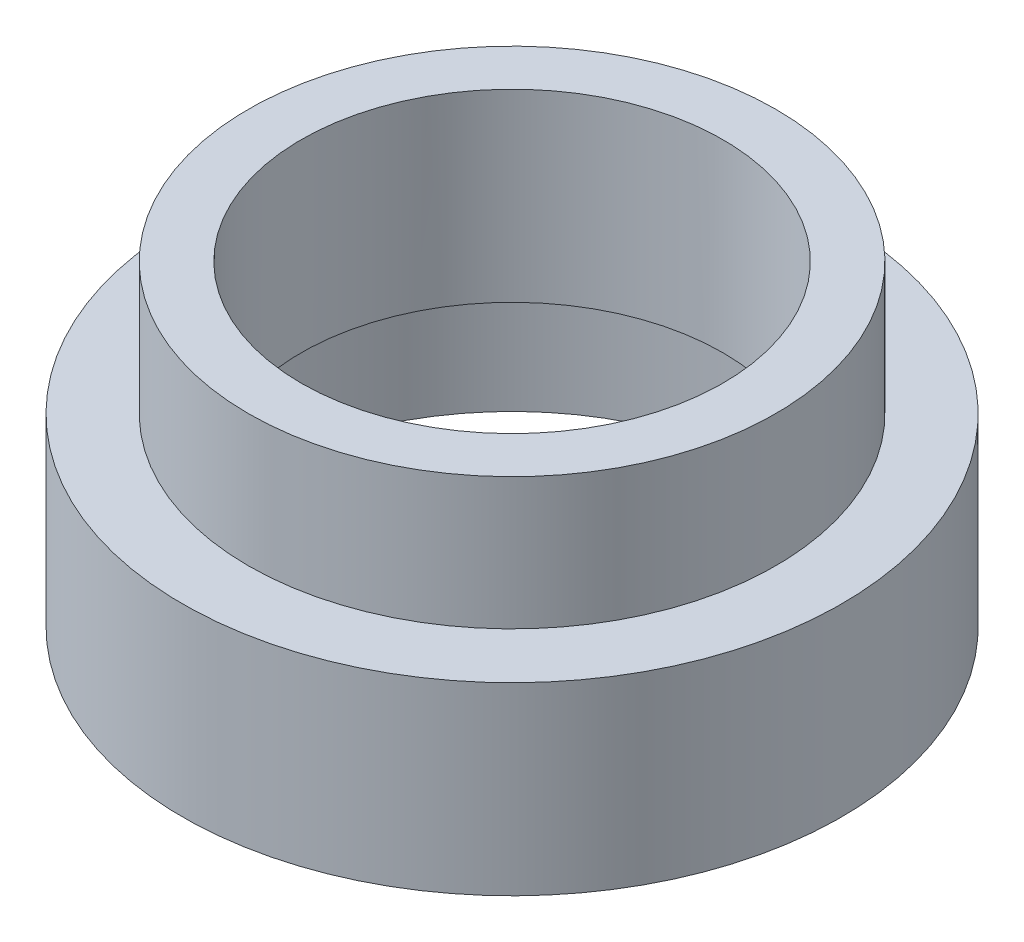
ISO-10303-21;
HEADER;
FILE_DESCRIPTION(('STEP AP214'),'2;1');
FILE_NAME('part.step','',(''),(''),'','','');
FILE_SCHEMA(('AUTOMOTIVE_DESIGN { 1 0 10303 214 1 1 1 1 }'));
ENDSEC;
DATA;
#1=APPLICATION_CONTEXT('core data for automotive mechanical design processes');
#2=APPLICATION_PROTOCOL_DEFINITION('international standard','automotive_design',2000,#1);
#3=PRODUCT_CONTEXT('',#1,'mechanical');
#4=PRODUCT('Part','Part','',(#3));
#5=PRODUCT_RELATED_PRODUCT_CATEGORY('part','',(#4));
#6=PRODUCT_DEFINITION_FORMATION('','',#4);
#7=PRODUCT_DEFINITION_CONTEXT('part definition',#1,'design');
#8=PRODUCT_DEFINITION('design','',#6,#7);
#9=PRODUCT_DEFINITION_SHAPE('','',#8);
#10=(LENGTH_UNIT() NAMED_UNIT(*) SI_UNIT(.MILLI.,.METRE.));
#11=(NAMED_UNIT(*) PLANE_ANGLE_UNIT() SI_UNIT($,.RADIAN.));
#12=(NAMED_UNIT(*) SI_UNIT($,.STERADIAN.) SOLID_ANGLE_UNIT());
#13=UNCERTAINTY_MEASURE_WITH_UNIT(LENGTH_MEASURE(1.E-05),#10,'distance_accuracy_value','');
#14=(GEOMETRIC_REPRESENTATION_CONTEXT(3) GLOBAL_UNCERTAINTY_ASSIGNED_CONTEXT((#13)) GLOBAL_UNIT_ASSIGNED_CONTEXT((#10,
#11,#12)) REPRESENTATION_CONTEXT('',''));
#15=CARTESIAN_POINT('',(0.,0.,0.));
#16=DIRECTION('',(0.,0.,1.));
#17=DIRECTION('',(1.,0.,0.));
#18=AXIS2_PLACEMENT_3D('',#15,#16,#17);
#19=CARTESIAN_POINT('',(0.,-5.,0.));
#20=DIRECTION('',(0.,1.,0.));
#21=DIRECTION('',(0.,0.,1.));
#22=AXIS2_PLACEMENT_3D('',#19,#20,#21);
#23=CYLINDRICAL_SURFACE('',#22,4.);
#24=CARTESIAN_POINT('',(0.,2.5,0.));
#25=DIRECTION('',(0.,1.,0.));
#26=DIRECTION('',(0.,0.,1.));
#27=AXIS2_PLACEMENT_3D('',#24,#25,#26);
#28=CIRCLE('',#27,4.);
#29=CARTESIAN_POINT('',(0.,2.5,4.));
#30=VERTEX_POINT('',#29);
#31=EDGE_CURVE('E49',#30,#30,#28,.T.);
#32=ORIENTED_EDGE('',*,*,#31,.T.);
#33=EDGE_LOOP('',(#32));
#34=FACE_BOUND('',#33,.T.);
#35=CARTESIAN_POINT('',(0.,-1.,0.));
#36=DIRECTION('',(0.,-1.,0.));
#37=DIRECTION('',(0.,0.,-1.));
#38=AXIS2_PLACEMENT_3D('',#35,#36,#37);
#39=CIRCLE('',#38,4.);
#40=CARTESIAN_POINT('',(0.,-1.,-4.));
#41=VERTEX_POINT('',#40);
#42=EDGE_CURVE('E35',#41,#41,#39,.F.);
#43=ORIENTED_EDGE('',*,*,#42,.F.);
#44=EDGE_LOOP('',(#43));
#45=FACE_BOUND('',#44,.T.);
#46=ADVANCED_FACE('F31',(#34,#45),#23,.F.);
#47=CARTESIAN_POINT('',(0.,2.5,0.));
#48=DIRECTION('',(0.,-1.,0.));
#49=DIRECTION('',(0.,0.,-1.));
#50=AXIS2_PLACEMENT_3D('',#47,#48,#49);
#51=CYLINDRICAL_SURFACE('',#50,5.);
#52=CARTESIAN_POINT('',(0.,2.5,0.));
#53=DIRECTION('',(0.,1.,0.));
#54=DIRECTION('',(0.,0.,1.));
#55=AXIS2_PLACEMENT_3D('',#52,#53,#54);
#56=CIRCLE('',#55,5.);
#57=CARTESIAN_POINT('',(0.,2.5,5.));
#58=VERTEX_POINT('',#57);
#59=EDGE_CURVE('E10',#58,#58,#56,.T.);
#60=ORIENTED_EDGE('',*,*,#59,.F.);
#61=EDGE_LOOP('',(#60));
#62=FACE_BOUND('',#61,.T.);
#63=CARTESIAN_POINT('',(0.,0.,0.));
#64=DIRECTION('',(0.,-1.,0.));
#65=DIRECTION('',(0.,0.,-1.));
#66=AXIS2_PLACEMENT_3D('',#63,#64,#65);
#67=CIRCLE('',#66,5.);
#68=CARTESIAN_POINT('',(0.,0.,-5.));
#69=VERTEX_POINT('',#68);
#70=EDGE_CURVE('E39',#69,#69,#67,.T.);
#71=ORIENTED_EDGE('',*,*,#70,.F.);
#72=EDGE_LOOP('',(#71));
#73=FACE_BOUND('',#72,.T.);
#74=ADVANCED_FACE('F33',(#62,#73),#51,.T.);
#75=CARTESIAN_POINT('',(0.,2.5,0.));
#76=DIRECTION('',(0.,1.,0.));
#77=DIRECTION('',(0.,0.,1.));
#78=AXIS2_PLACEMENT_3D('',#75,#76,#77);
#79=PLANE('',#78);
#80=ORIENTED_EDGE('',*,*,#31,.F.);
#81=EDGE_LOOP('',(#80));
#82=FACE_BOUND('',#81,.T.);
#83=ORIENTED_EDGE('',*,*,#59,.T.);
#84=EDGE_LOOP('',(#83));
#85=FACE_BOUND('',#84,.T.);
#86=ADVANCED_FACE('F72',(#82,#85),#79,.T.);
#87=CARTESIAN_POINT('',(0.,-3.5,0.));
#88=DIRECTION('',(0.,1.,0.));
#89=DIRECTION('',(0.,0.,1.));
#90=AXIS2_PLACEMENT_3D('',#87,#88,#89);
#91=CYLINDRICAL_SURFACE('',#90,6.25);
#92=CARTESIAN_POINT('',(0.,-3.5,0.));
#93=DIRECTION('',(0.,-1.,0.));
#94=DIRECTION('',(0.,0.,-1.));
#95=AXIS2_PLACEMENT_3D('',#92,#93,#94);
#96=CIRCLE('',#95,6.25);
#97=CARTESIAN_POINT('',(0.,-3.5,-6.25));
#98=VERTEX_POINT('',#97);
#99=EDGE_CURVE('E43',#98,#98,#96,.T.);
#100=ORIENTED_EDGE('',*,*,#99,.F.);
#101=EDGE_LOOP('',(#100));
#102=FACE_BOUND('',#101,.T.);
#103=CARTESIAN_POINT('',(0.,0.,0.));
#104=DIRECTION('',(0.,-1.,0.));
#105=DIRECTION('',(0.,0.,-1.));
#106=AXIS2_PLACEMENT_3D('',#103,#104,#105);
#107=CIRCLE('',#106,6.25);
#108=CARTESIAN_POINT('',(0.,0.,-6.25));
#109=VERTEX_POINT('',#108);
#110=EDGE_CURVE('E46',#109,#109,#107,.T.);
#111=ORIENTED_EDGE('',*,*,#110,.T.);
#112=EDGE_LOOP('',(#111));
#113=FACE_BOUND('',#112,.T.);
#114=ADVANCED_FACE('F82',(#102,#113),#91,.T.);
#115=CARTESIAN_POINT('',(0.,-3.5,0.));
#116=DIRECTION('',(0.,-1.,0.));
#117=DIRECTION('',(0.,0.,-1.));
#118=AXIS2_PLACEMENT_3D('',#115,#116,#117);
#119=PLANE('',#118);
#120=CARTESIAN_POINT('',(0.,-3.5,0.));
#121=DIRECTION('',(0.,-1.,0.));
#122=DIRECTION('',(0.,0.,-1.));
#123=AXIS2_PLACEMENT_3D('',#120,#121,#122);
#124=CIRCLE('',#123,5.);
#125=CARTESIAN_POINT('',(0.,-3.5,-5.));
#126=VERTEX_POINT('',#125);
#127=EDGE_CURVE('E54',#126,#126,#124,.T.);
#128=ORIENTED_EDGE('',*,*,#127,.F.);
#129=EDGE_LOOP('',(#128));
#130=FACE_BOUND('',#129,.T.);
#131=ORIENTED_EDGE('',*,*,#99,.T.);
#132=EDGE_LOOP('',(#131));
#133=FACE_BOUND('',#132,.T.);
#134=ADVANCED_FACE('F78',(#130,#133),#119,.T.);
#135=CARTESIAN_POINT('',(0.,0.,0.));
#136=DIRECTION('',(0.,-1.,0.));
#137=DIRECTION('',(0.,0.,-1.));
#138=AXIS2_PLACEMENT_3D('',#135,#136,#137);
#139=PLANE('',#138);
#140=ORIENTED_EDGE('',*,*,#70,.T.);
#141=EDGE_LOOP('',(#140));
#142=FACE_BOUND('',#141,.T.);
#143=ORIENTED_EDGE('',*,*,#110,.F.);
#144=EDGE_LOOP('',(#143));
#145=FACE_BOUND('',#144,.T.);
#146=ADVANCED_FACE('F81',(#142,#145),#139,.F.);
#147=CARTESIAN_POINT('',(0.,-1.,0.));
#148=DIRECTION('',(0.,-1.,0.));
#149=DIRECTION('',(0.,0.,-1.));
#150=AXIS2_PLACEMENT_3D('',#147,#148,#149);
#151=PLANE('',#150);
#152=CARTESIAN_POINT('',(0.,-1.,0.));
#153=DIRECTION('',(0.,-1.,0.));
#154=DIRECTION('',(0.,0.,-1.));
#155=AXIS2_PLACEMENT_3D('',#152,#153,#154);
#156=CIRCLE('',#155,5.);
#157=CARTESIAN_POINT('',(0.,-1.,-5.));
#158=VERTEX_POINT('',#157);
#159=EDGE_CURVE('E57',#158,#158,#156,.T.);
#160=ORIENTED_EDGE('',*,*,#159,.T.);
#161=EDGE_LOOP('',(#160));
#162=FACE_BOUND('',#161,.T.);
#163=ORIENTED_EDGE('',*,*,#42,.T.);
#164=EDGE_LOOP('',(#163));
#165=FACE_BOUND('',#164,.T.);
#166=ADVANCED_FACE('F64',(#162,#165),#151,.T.);
#167=CARTESIAN_POINT('',(0.,-1.,0.));
#168=DIRECTION('',(0.,-1.,0.));
#169=DIRECTION('',(0.,0.,-1.));
#170=AXIS2_PLACEMENT_3D('',#167,#168,#169);
#171=CYLINDRICAL_SURFACE('',#170,5.);
#172=ORIENTED_EDGE('',*,*,#159,.F.);
#173=EDGE_LOOP('',(#172));
#174=FACE_BOUND('',#173,.T.);
#175=ORIENTED_EDGE('',*,*,#127,.T.);
#176=EDGE_LOOP('',(#175));
#177=FACE_BOUND('',#176,.T.);
#178=ADVANCED_FACE('F76',(#174,#177),#171,.F.);
#179=CLOSED_SHELL('',(#46,#74,#86,#114,#134,#146,#166,#178));
#180=MANIFOLD_SOLID_BREP('B2',#179);
#181=ADVANCED_BREP_SHAPE_REPRESENTATION('',(#18,#180),#14);
#182=SHAPE_DEFINITION_REPRESENTATION(#9,#181);
ENDSEC;
END-ISO-10303-21;
